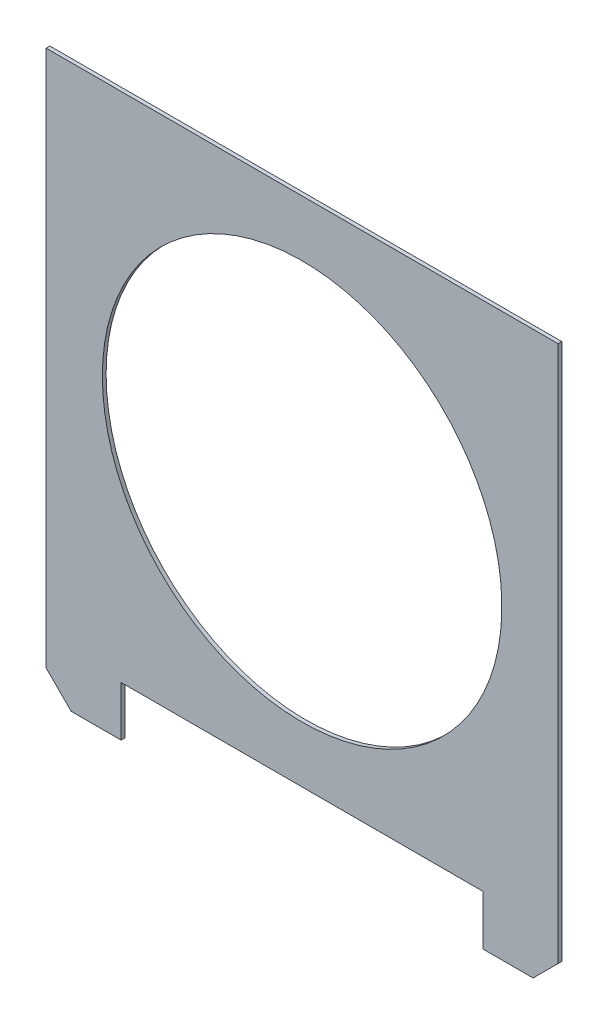
ISO-10303-21;
HEADER;
FILE_DESCRIPTION(('STEP AP214'),'2;1');
FILE_NAME('part.step','',(''),(''),'','','');
FILE_SCHEMA(('AUTOMOTIVE_DESIGN { 1 0 10303 214 1 1 1 1 }'));
ENDSEC;
DATA;
#1=APPLICATION_CONTEXT('core data for automotive mechanical design processes');
#2=APPLICATION_PROTOCOL_DEFINITION('international standard','automotive_design',2000,#1);
#3=PRODUCT_CONTEXT('',#1,'mechanical');
#4=PRODUCT('Part','Part','',(#3));
#5=PRODUCT_RELATED_PRODUCT_CATEGORY('part','',(#4));
#6=PRODUCT_DEFINITION_FORMATION('','',#4);
#7=PRODUCT_DEFINITION_CONTEXT('part definition',#1,'design');
#8=PRODUCT_DEFINITION('design','',#6,#7);
#9=PRODUCT_DEFINITION_SHAPE('','',#8);
#10=(LENGTH_UNIT() NAMED_UNIT(*) SI_UNIT(.MILLI.,.METRE.));
#11=(NAMED_UNIT(*) PLANE_ANGLE_UNIT() SI_UNIT($,.RADIAN.));
#12=(NAMED_UNIT(*) SI_UNIT($,.STERADIAN.) SOLID_ANGLE_UNIT());
#13=UNCERTAINTY_MEASURE_WITH_UNIT(LENGTH_MEASURE(1.E-05),#10,'distance_accuracy_value','');
#14=(GEOMETRIC_REPRESENTATION_CONTEXT(3) GLOBAL_UNCERTAINTY_ASSIGNED_CONTEXT((#13)) GLOBAL_UNIT_ASSIGNED_CONTEXT((#10,
#11,#12)) REPRESENTATION_CONTEXT('',''));
#15=CARTESIAN_POINT('',(0.,0.,0.));
#16=DIRECTION('',(0.,0.,1.));
#17=DIRECTION('',(1.,0.,0.));
#18=AXIS2_PLACEMENT_3D('',#15,#16,#17);
#19=CARTESIAN_POINT('',(-20.5,-20.5,0.3));
#20=DIRECTION('',(0.,1.,0.));
#21=DIRECTION('',(0.,0.,1.));
#22=AXIS2_PLACEMENT_3D('',#19,#20,#21);
#23=PLANE('',#22);
#24=DIRECTION('',(1.,0.,0.));
#25=VECTOR('',#24,1.);
#26=CARTESIAN_POINT('',(-20.5,-20.5,0.3));
#27=LINE('',#26,#25);
#28=CARTESIAN_POINT('',(-14.5,-20.5,0.3));
#29=VERTEX_POINT('',#28);
#30=CARTESIAN_POINT('',(14.5,-20.5,0.3));
#31=VERTEX_POINT('',#30);
#32=EDGE_CURVE('E140',#29,#31,#27,.T.);
#33=ORIENTED_EDGE('',*,*,#32,.F.);
#34=DIRECTION('',(0.,0.,-1.));
#35=VECTOR('',#34,1.);
#36=CARTESIAN_POINT('',(-14.5,-20.5,7.51110255092798));
#37=LINE('',#36,#35);
#38=CARTESIAN_POINT('',(-14.5,-20.5,0.));
#39=VERTEX_POINT('',#38);
#40=EDGE_CURVE('E201',#29,#39,#37,.T.);
#41=ORIENTED_EDGE('',*,*,#40,.T.);
#42=DIRECTION('',(1.,0.,0.));
#43=VECTOR('',#42,1.);
#44=CARTESIAN_POINT('',(-20.5,-20.5,0.));
#45=LINE('',#44,#43);
#46=CARTESIAN_POINT('',(14.5,-20.5,0.));
#47=VERTEX_POINT('',#46);
#48=EDGE_CURVE('E152',#39,#47,#45,.T.);
#49=ORIENTED_EDGE('',*,*,#48,.T.);
#50=DIRECTION('',(0.,0.,-1.));
#51=VECTOR('',#50,1.);
#52=CARTESIAN_POINT('',(14.5,-20.5,7.51110255092798));
#53=LINE('',#52,#51);
#54=EDGE_CURVE('E206',#31,#47,#53,.T.);
#55=ORIENTED_EDGE('',*,*,#54,.F.);
#56=EDGE_LOOP('',(#33,#41,#49,#55));
#57=FACE_BOUND('',#56,.T.);
#58=ADVANCED_FACE('F39',(#57),#23,.F.);
#59=CARTESIAN_POINT('',(-20.5,20.5,0.3));
#60=DIRECTION('',(0.,-1.,0.));
#61=DIRECTION('',(0.,0.,-1.));
#62=AXIS2_PLACEMENT_3D('',#59,#60,#61);
#63=PLANE('',#62);
#64=DIRECTION('',(-1.,0.,0.));
#65=VECTOR('',#64,1.);
#66=CARTESIAN_POINT('',(-20.5,20.5,0.));
#67=LINE('',#66,#65);
#68=CARTESIAN_POINT('',(20.5,20.5,0.));
#69=VERTEX_POINT('',#68);
#70=CARTESIAN_POINT('',(-20.5,20.5,0.));
#71=VERTEX_POINT('',#70);
#72=EDGE_CURVE('E131',#69,#71,#67,.T.);
#73=ORIENTED_EDGE('',*,*,#72,.T.);
#74=DIRECTION('',(0.,0.,-1.));
#75=VECTOR('',#74,1.);
#76=CARTESIAN_POINT('',(-20.5,20.5,0.300000000000002));
#77=LINE('',#76,#75);
#78=CARTESIAN_POINT('',(-20.5,20.5,0.300000000000002));
#79=VERTEX_POINT('',#78);
#80=EDGE_CURVE('E128',#79,#71,#77,.T.);
#81=ORIENTED_EDGE('',*,*,#80,.F.);
#82=DIRECTION('',(-1.,0.,0.));
#83=VECTOR('',#82,1.);
#84=CARTESIAN_POINT('',(-20.5,20.5,0.3));
#85=LINE('',#84,#83);
#86=CARTESIAN_POINT('',(20.5,20.5,0.3));
#87=VERTEX_POINT('',#86);
#88=EDGE_CURVE('E115',#87,#79,#85,.T.);
#89=ORIENTED_EDGE('',*,*,#88,.F.);
#90=DIRECTION('',(0.,0.,-1.));
#91=VECTOR('',#90,1.);
#92=CARTESIAN_POINT('',(20.5,20.5,0.3));
#93=LINE('',#92,#91);
#94=EDGE_CURVE('E142',#87,#69,#93,.T.);
#95=ORIENTED_EDGE('',*,*,#94,.T.);
#96=EDGE_LOOP('',(#73,#81,#89,#95));
#97=FACE_BOUND('',#96,.T.);
#98=ADVANCED_FACE('F129',(#97),#63,.F.);
#99=CARTESIAN_POINT('',(20.5,-20.5,0.3));
#100=DIRECTION('',(-1.,0.,0.));
#101=DIRECTION('',(0.,0.,1.));
#102=AXIS2_PLACEMENT_3D('',#99,#100,#101);
#103=PLANE('',#102);
#104=DIRECTION('',(0.,1.,0.));
#105=VECTOR('',#104,1.);
#106=CARTESIAN_POINT('',(20.5,-20.5,0.3));
#107=LINE('',#106,#105);
#108=CARTESIAN_POINT('',(20.5,-22.5,0.3));
#109=VERTEX_POINT('',#108);
#110=EDGE_CURVE('E122',#109,#87,#107,.T.);
#111=ORIENTED_EDGE('',*,*,#110,.F.);
#112=DIRECTION('',(0.,0.,-1.));
#113=VECTOR('',#112,1.);
#114=CARTESIAN_POINT('',(20.5,-22.5,0.));
#115=LINE('',#114,#113);
#116=CARTESIAN_POINT('',(20.5,-22.5,0.));
#117=VERTEX_POINT('',#116);
#118=EDGE_CURVE('E164',#109,#117,#115,.T.);
#119=ORIENTED_EDGE('',*,*,#118,.T.);
#120=DIRECTION('',(0.,1.,0.));
#121=VECTOR('',#120,1.);
#122=CARTESIAN_POINT('',(20.5,-20.5,0.));
#123=LINE('',#122,#121);
#124=EDGE_CURVE('E146',#117,#69,#123,.T.);
#125=ORIENTED_EDGE('',*,*,#124,.T.);
#126=ORIENTED_EDGE('',*,*,#94,.F.);
#127=EDGE_LOOP('',(#111,#119,#125,#126));
#128=FACE_BOUND('',#127,.T.);
#129=ADVANCED_FACE('F169',(#128),#103,.F.);
#130=CARTESIAN_POINT('',(-20.5,-20.5,0.3));
#131=DIRECTION('',(1.,0.,0.));
#132=DIRECTION('',(0.,0.,-1.));
#133=AXIS2_PLACEMENT_3D('',#130,#131,#132);
#134=PLANE('',#133);
#135=DIRECTION('',(0.,-1.,0.));
#136=VECTOR('',#135,1.);
#137=CARTESIAN_POINT('',(-20.5,-20.5,0.3));
#138=LINE('',#137,#136);
#139=CARTESIAN_POINT('',(-20.5,-22.5,0.3));
#140=VERTEX_POINT('',#139);
#141=EDGE_CURVE('E119',#79,#140,#138,.T.);
#142=ORIENTED_EDGE('',*,*,#141,.F.);
#143=ORIENTED_EDGE('',*,*,#80,.T.);
#144=DIRECTION('',(0.,-1.,0.));
#145=VECTOR('',#144,1.);
#146=CARTESIAN_POINT('',(-20.5,-20.5,0.));
#147=LINE('',#146,#145);
#148=CARTESIAN_POINT('',(-20.5,-22.5,0.));
#149=VERTEX_POINT('',#148);
#150=EDGE_CURVE('E150',#71,#149,#147,.T.);
#151=ORIENTED_EDGE('',*,*,#150,.T.);
#152=DIRECTION('',(0.,0.,1.));
#153=VECTOR('',#152,1.);
#154=CARTESIAN_POINT('',(-20.5,-22.5,0.3));
#155=LINE('',#154,#153);
#156=EDGE_CURVE('E138',#149,#140,#155,.T.);
#157=ORIENTED_EDGE('',*,*,#156,.T.);
#158=EDGE_LOOP('',(#142,#143,#151,#157));
#159=FACE_BOUND('',#158,.T.);
#160=ADVANCED_FACE('F136',(#159),#134,.F.);
#161=CARTESIAN_POINT('',(0.,0.,0.3));
#162=DIRECTION('',(0.,0.,-1.));
#163=DIRECTION('',(-1.,0.,0.));
#164=AXIS2_PLACEMENT_3D('',#161,#162,#163);
#165=PLANE('',#164);
#166=CARTESIAN_POINT('',(0.,0.,0.300000000000002));
#167=DIRECTION('',(0.,0.,-1.));
#168=DIRECTION('',(-1.,0.,0.));
#169=AXIS2_PLACEMENT_3D('',#166,#167,#168);
#170=CIRCLE('',#169,16.);
#171=CARTESIAN_POINT('',(-16.,0.,0.300000000000002));
#172=VERTEX_POINT('',#171);
#173=EDGE_CURVE('E199',#172,#172,#170,.T.);
#174=ORIENTED_EDGE('',*,*,#173,.T.);
#175=EDGE_LOOP('',(#174));
#176=FACE_BOUND('',#175,.T.);
#177=ORIENTED_EDGE('',*,*,#88,.T.);
#178=ORIENTED_EDGE('',*,*,#141,.T.);
#179=DIRECTION('',(0.707106781186546,-0.707106781186549,0.));
#180=VECTOR('',#179,1.);
#181=CARTESIAN_POINT('',(-18.5,-24.5,0.3));
#182=LINE('',#181,#180);
#183=CARTESIAN_POINT('',(-18.5,-24.5,0.3));
#184=VERTEX_POINT('',#183);
#185=EDGE_CURVE('E162',#140,#184,#182,.T.);
#186=ORIENTED_EDGE('',*,*,#185,.T.);
#187=DIRECTION('',(1.,0.,0.));
#188=VECTOR('',#187,1.);
#189=CARTESIAN_POINT('',(-20.5,-24.5,0.3));
#190=LINE('',#189,#188);
#191=CARTESIAN_POINT('',(-14.5,-24.5,0.3));
#192=VERTEX_POINT('',#191);
#193=EDGE_CURVE('E183',#184,#192,#190,.T.);
#194=ORIENTED_EDGE('',*,*,#193,.T.);
#195=DIRECTION('',(0.,1.,0.));
#196=VECTOR('',#195,1.);
#197=CARTESIAN_POINT('',(-14.5,-20.5,0.3));
#198=LINE('',#197,#196);
#199=EDGE_CURVE('E190',#192,#29,#198,.T.);
#200=ORIENTED_EDGE('',*,*,#199,.T.);
#201=ORIENTED_EDGE('',*,*,#32,.T.);
#202=DIRECTION('',(0.,-1.,0.));
#203=VECTOR('',#202,1.);
#204=CARTESIAN_POINT('',(14.5,-20.5,0.3));
#205=LINE('',#204,#203);
#206=CARTESIAN_POINT('',(14.5,-24.5,0.300000000000002));
#207=VERTEX_POINT('',#206);
#208=EDGE_CURVE('E205',#31,#207,#205,.T.);
#209=ORIENTED_EDGE('',*,*,#208,.T.);
#210=DIRECTION('',(1.,0.,0.));
#211=VECTOR('',#210,1.);
#212=CARTESIAN_POINT('',(20.5,-24.5,0.3));
#213=LINE('',#212,#211);
#214=CARTESIAN_POINT('',(18.5,-24.5,0.3));
#215=VERTEX_POINT('',#214);
#216=EDGE_CURVE('E148',#207,#215,#213,.T.);
#217=ORIENTED_EDGE('',*,*,#216,.T.);
#218=DIRECTION('',(0.707106781186549,0.707106781186546,0.));
#219=VECTOR('',#218,1.);
#220=CARTESIAN_POINT('',(20.5,-22.5,0.3));
#221=LINE('',#220,#219);
#222=EDGE_CURVE('E11',#215,#109,#221,.T.);
#223=ORIENTED_EDGE('',*,*,#222,.T.);
#224=ORIENTED_EDGE('',*,*,#110,.T.);
#225=EDGE_LOOP('',(#177,#178,#186,#194,#200,#201,#209,#217,#223,#224));
#226=FACE_BOUND('',#225,.T.);
#227=ADVANCED_FACE('F117',(#176,#226),#165,.F.);
#228=CARTESIAN_POINT('',(0.,0.,0.));
#229=DIRECTION('',(0.,0.,-1.));
#230=DIRECTION('',(-1.,0.,0.));
#231=AXIS2_PLACEMENT_3D('',#228,#229,#230);
#232=PLANE('',#231);
#233=ORIENTED_EDGE('',*,*,#150,.F.);
#234=ORIENTED_EDGE('',*,*,#72,.F.);
#235=ORIENTED_EDGE('',*,*,#124,.F.);
#236=DIRECTION('',(-0.707106781186549,-0.707106781186546,0.));
#237=VECTOR('',#236,1.);
#238=CARTESIAN_POINT('',(21.5,-21.5,0.));
#239=LINE('',#238,#237);
#240=CARTESIAN_POINT('',(18.5,-24.5,0.));
#241=VERTEX_POINT('',#240);
#242=EDGE_CURVE('E62',#117,#241,#239,.T.);
#243=ORIENTED_EDGE('',*,*,#242,.T.);
#244=DIRECTION('',(-1.,0.,0.));
#245=VECTOR('',#244,1.);
#246=CARTESIAN_POINT('',(20.5,-24.5,0.));
#247=LINE('',#246,#245);
#248=CARTESIAN_POINT('',(14.5,-24.5,0.));
#249=VERTEX_POINT('',#248);
#250=EDGE_CURVE('E189',#241,#249,#247,.T.);
#251=ORIENTED_EDGE('',*,*,#250,.T.);
#252=DIRECTION('',(0.,1.,0.));
#253=VECTOR('',#252,1.);
#254=CARTESIAN_POINT('',(14.5,-20.5,0.));
#255=LINE('',#254,#253);
#256=EDGE_CURVE('E192',#249,#47,#255,.T.);
#257=ORIENTED_EDGE('',*,*,#256,.T.);
#258=ORIENTED_EDGE('',*,*,#48,.F.);
#259=DIRECTION('',(0.,-1.,0.));
#260=VECTOR('',#259,1.);
#261=CARTESIAN_POINT('',(-14.5,-20.5,0.));
#262=LINE('',#261,#260);
#263=CARTESIAN_POINT('',(-14.5,-24.5,0.));
#264=VERTEX_POINT('',#263);
#265=EDGE_CURVE('E197',#39,#264,#262,.T.);
#266=ORIENTED_EDGE('',*,*,#265,.T.);
#267=DIRECTION('',(-1.,0.,0.));
#268=VECTOR('',#267,1.);
#269=CARTESIAN_POINT('',(-20.5,-24.5,0.));
#270=LINE('',#269,#268);
#271=CARTESIAN_POINT('',(-18.5,-24.5,0.));
#272=VERTEX_POINT('',#271);
#273=EDGE_CURVE('E177',#264,#272,#270,.T.);
#274=ORIENTED_EDGE('',*,*,#273,.T.);
#275=DIRECTION('',(-0.707106781186546,0.707106781186549,0.));
#276=VECTOR('',#275,1.);
#277=CARTESIAN_POINT('',(-21.5,-21.5,0.));
#278=LINE('',#277,#276);
#279=EDGE_CURVE('E158',#272,#149,#278,.T.);
#280=ORIENTED_EDGE('',*,*,#279,.T.);
#281=EDGE_LOOP('',(#233,#234,#235,#243,#251,#257,#258,#266,#274,#280));
#282=FACE_BOUND('',#281,.T.);
#283=CARTESIAN_POINT('',(0.,0.,0.));
#284=DIRECTION('',(0.,0.,-1.));
#285=DIRECTION('',(-1.,0.,0.));
#286=AXIS2_PLACEMENT_3D('',#283,#284,#285);
#287=CIRCLE('',#286,16.);
#288=CARTESIAN_POINT('',(-16.,0.,0.));
#289=VERTEX_POINT('',#288);
#290=EDGE_CURVE('E134',#289,#289,#287,.T.);
#291=ORIENTED_EDGE('',*,*,#290,.F.);
#292=EDGE_LOOP('',(#291));
#293=FACE_BOUND('',#292,.T.);
#294=ADVANCED_FACE('F172',(#282,#293),#232,.T.);
#295=CARTESIAN_POINT('',(14.5,-20.5,7.51110255092798));
#296=DIRECTION('',(-1.,0.,0.));
#297=DIRECTION('',(0.,-1.,0.));
#298=AXIS2_PLACEMENT_3D('',#295,#296,#297);
#299=PLANE('',#298);
#300=ORIENTED_EDGE('',*,*,#208,.F.);
#301=ORIENTED_EDGE('',*,*,#54,.T.);
#302=ORIENTED_EDGE('',*,*,#256,.F.);
#303=DIRECTION('',(0.,0.,-1.));
#304=VECTOR('',#303,1.);
#305=CARTESIAN_POINT('',(14.5,-24.5,7.51110255092798));
#306=LINE('',#305,#304);
#307=EDGE_CURVE('E210',#207,#249,#306,.T.);
#308=ORIENTED_EDGE('',*,*,#307,.F.);
#309=EDGE_LOOP('',(#300,#301,#302,#308));
#310=FACE_BOUND('',#309,.T.);
#311=ADVANCED_FACE('F262',(#310),#299,.T.);
#312=CARTESIAN_POINT('',(20.5,-24.5,7.51110255092798));
#313=DIRECTION('',(0.,-1.,0.));
#314=DIRECTION('',(0.,0.,-1.));
#315=AXIS2_PLACEMENT_3D('',#312,#313,#314);
#316=PLANE('',#315);
#317=ORIENTED_EDGE('',*,*,#250,.F.);
#318=DIRECTION('',(0.,0.,1.));
#319=VECTOR('',#318,1.);
#320=CARTESIAN_POINT('',(18.5,-24.5,0.3));
#321=LINE('',#320,#319);
#322=EDGE_CURVE('E48',#241,#215,#321,.T.);
#323=ORIENTED_EDGE('',*,*,#322,.T.);
#324=ORIENTED_EDGE('',*,*,#216,.F.);
#325=ORIENTED_EDGE('',*,*,#307,.T.);
#326=EDGE_LOOP('',(#317,#323,#324,#325));
#327=FACE_BOUND('',#326,.T.);
#328=ADVANCED_FACE('F268',(#327),#316,.T.);
#329=CARTESIAN_POINT('',(-20.5,-24.5,7.51110255092798));
#330=DIRECTION('',(0.,-1.,0.));
#331=DIRECTION('',(0.,0.,-1.));
#332=AXIS2_PLACEMENT_3D('',#329,#330,#331);
#333=PLANE('',#332);
#334=ORIENTED_EDGE('',*,*,#193,.F.);
#335=DIRECTION('',(0.,0.,-1.));
#336=VECTOR('',#335,1.);
#337=CARTESIAN_POINT('',(-18.5,-24.5,0.));
#338=LINE('',#337,#336);
#339=EDGE_CURVE('E155',#184,#272,#338,.T.);
#340=ORIENTED_EDGE('',*,*,#339,.T.);
#341=ORIENTED_EDGE('',*,*,#273,.F.);
#342=DIRECTION('',(0.,0.,-1.));
#343=VECTOR('',#342,1.);
#344=CARTESIAN_POINT('',(-14.5,-24.5,7.51110255092798));
#345=LINE('',#344,#343);
#346=EDGE_CURVE('E188',#192,#264,#345,.T.);
#347=ORIENTED_EDGE('',*,*,#346,.F.);
#348=EDGE_LOOP('',(#334,#340,#341,#347));
#349=FACE_BOUND('',#348,.T.);
#350=ADVANCED_FACE('F187',(#349),#333,.T.);
#351=CARTESIAN_POINT('',(-14.5,-20.5,7.51110255092798));
#352=DIRECTION('',(1.,0.,0.));
#353=DIRECTION('',(0.,1.,0.));
#354=AXIS2_PLACEMENT_3D('',#351,#352,#353);
#355=PLANE('',#354);
#356=ORIENTED_EDGE('',*,*,#199,.F.);
#357=ORIENTED_EDGE('',*,*,#346,.T.);
#358=ORIENTED_EDGE('',*,*,#265,.F.);
#359=ORIENTED_EDGE('',*,*,#40,.F.);
#360=EDGE_LOOP('',(#356,#357,#358,#359));
#361=FACE_BOUND('',#360,.T.);
#362=ADVANCED_FACE('F282',(#361),#355,.T.);
#363=CARTESIAN_POINT('',(0.,0.,0.300000000000002));
#364=DIRECTION('',(0.,0.,-1.));
#365=DIRECTION('',(-1.,0.,0.));
#366=AXIS2_PLACEMENT_3D('',#363,#364,#365);
#367=CYLINDRICAL_SURFACE('',#366,16.);
#368=ORIENTED_EDGE('',*,*,#173,.F.);
#369=EDGE_LOOP('',(#368));
#370=FACE_BOUND('',#369,.T.);
#371=ORIENTED_EDGE('',*,*,#290,.T.);
#372=EDGE_LOOP('',(#371));
#373=FACE_BOUND('',#372,.T.);
#374=ADVANCED_FACE('F221',(#370,#373),#367,.F.);
#375=CARTESIAN_POINT('',(-18.5,-24.5,7.51110255092798));
#376=DIRECTION('',(-0.707106781186549,-0.707106781186546,0.));
#377=DIRECTION('',(0.,0.,1.));
#378=AXIS2_PLACEMENT_3D('',#375,#376,#377);
#379=PLANE('',#378);
#380=ORIENTED_EDGE('',*,*,#185,.F.);
#381=ORIENTED_EDGE('',*,*,#156,.F.);
#382=ORIENTED_EDGE('',*,*,#279,.F.);
#383=ORIENTED_EDGE('',*,*,#339,.F.);
#384=EDGE_LOOP('',(#380,#381,#382,#383));
#385=FACE_BOUND('',#384,.T.);
#386=ADVANCED_FACE('F180',(#385),#379,.T.);
#387=CARTESIAN_POINT('',(20.5,-22.5,0.3));
#388=DIRECTION('',(0.707106781186546,-0.707106781186549,0.));
#389=DIRECTION('',(0.,0.,1.));
#390=AXIS2_PLACEMENT_3D('',#387,#388,#389);
#391=PLANE('',#390);
#392=ORIENTED_EDGE('',*,*,#222,.F.);
#393=ORIENTED_EDGE('',*,*,#322,.F.);
#394=ORIENTED_EDGE('',*,*,#242,.F.);
#395=ORIENTED_EDGE('',*,*,#118,.F.);
#396=EDGE_LOOP('',(#392,#393,#394,#395));
#397=FACE_BOUND('',#396,.T.);
#398=ADVANCED_FACE('F42',(#397),#391,.T.);
#399=CLOSED_SHELL('',(#58,#98,#129,#160,#227,#294,#311,#328,#350,#362,#374,#386,#398));
#400=MANIFOLD_SOLID_BREP('B2',#399);
#401=ADVANCED_BREP_SHAPE_REPRESENTATION('',(#18,#400),#14);
#402=SHAPE_DEFINITION_REPRESENTATION(#9,#401);
ENDSEC;
END-ISO-10303-21;
